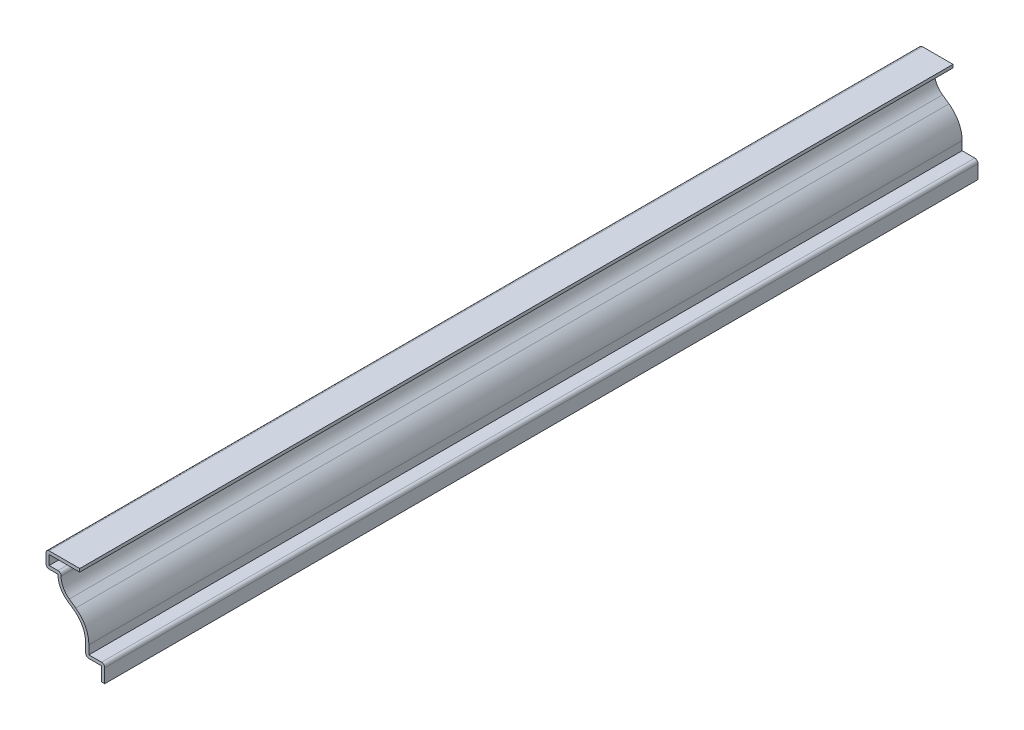
ISO-10303-21;
HEADER;
FILE_DESCRIPTION(('STEP AP214'),'2;1');
FILE_NAME('part.step','',(''),(''),'','','');
FILE_SCHEMA(('AUTOMOTIVE_DESIGN { 1 0 10303 214 1 1 1 1 }'));
ENDSEC;
DATA;
#1=APPLICATION_CONTEXT('core data for automotive mechanical design processes');
#2=APPLICATION_PROTOCOL_DEFINITION('international standard','automotive_design',2000,#1);
#3=PRODUCT_CONTEXT('',#1,'mechanical');
#4=PRODUCT('Part','Part','',(#3));
#5=PRODUCT_RELATED_PRODUCT_CATEGORY('part','',(#4));
#6=PRODUCT_DEFINITION_FORMATION('','',#4);
#7=PRODUCT_DEFINITION_CONTEXT('part definition',#1,'design');
#8=PRODUCT_DEFINITION('design','',#6,#7);
#9=PRODUCT_DEFINITION_SHAPE('','',#8);
#10=(LENGTH_UNIT() NAMED_UNIT(*) SI_UNIT(.MILLI.,.METRE.));
#11=(NAMED_UNIT(*) PLANE_ANGLE_UNIT() SI_UNIT($,.RADIAN.));
#12=(NAMED_UNIT(*) SI_UNIT($,.STERADIAN.) SOLID_ANGLE_UNIT());
#13=UNCERTAINTY_MEASURE_WITH_UNIT(LENGTH_MEASURE(1.E-05),#10,'distance_accuracy_value','');
#14=(GEOMETRIC_REPRESENTATION_CONTEXT(3) GLOBAL_UNCERTAINTY_ASSIGNED_CONTEXT((#13)) GLOBAL_UNIT_ASSIGNED_CONTEXT((#10,
#11,#12)) REPRESENTATION_CONTEXT('',''));
#15=CARTESIAN_POINT('',(0.,0.,0.));
#16=DIRECTION('',(0.,0.,1.));
#17=DIRECTION('',(1.,0.,0.));
#18=AXIS2_PLACEMENT_3D('',#15,#16,#17);
#19=CARTESIAN_POINT('',(-22.225,33.655,-349.25));
#20=DIRECTION('',(0.,-1.,0.));
#21=DIRECTION('',(0.,0.,-1.));
#22=AXIS2_PLACEMENT_3D('',#19,#20,#21);
#23=PLANE('',#22);
#24=DIRECTION('',(1.,0.,0.));
#25=VECTOR('',#24,1.);
#26=CARTESIAN_POINT('',(-22.225,33.655,0.));
#27=LINE('',#26,#25);
#28=CARTESIAN_POINT('',(-20.955,33.655,0.));
#29=VERTEX_POINT('',#28);
#30=CARTESIAN_POINT('',(-8.73125,33.655,0.));
#31=VERTEX_POINT('',#30);
#32=EDGE_CURVE('E275',#29,#31,#27,.T.);
#33=ORIENTED_EDGE('',*,*,#32,.F.);
#34=DIRECTION('',(0.,0.,1.));
#35=VECTOR('',#34,1.);
#36=CARTESIAN_POINT('',(-20.955,33.655,-349.25));
#37=LINE('',#36,#35);
#38=CARTESIAN_POINT('',(-20.955,33.655,-349.25));
#39=VERTEX_POINT('',#38);
#40=EDGE_CURVE('E227',#39,#29,#37,.T.);
#41=ORIENTED_EDGE('',*,*,#40,.F.);
#42=DIRECTION('',(1.,0.,0.));
#43=VECTOR('',#42,1.);
#44=CARTESIAN_POINT('',(-22.225,33.655,-349.25));
#45=LINE('',#44,#43);
#46=CARTESIAN_POINT('',(-8.73125,33.655,-349.25));
#47=VERTEX_POINT('',#46);
#48=EDGE_CURVE('E209',#39,#47,#45,.T.);
#49=ORIENTED_EDGE('',*,*,#48,.T.);
#50=DIRECTION('',(0.,0.,1.));
#51=VECTOR('',#50,1.);
#52=CARTESIAN_POINT('',(-8.73125,33.655,-349.25));
#53=LINE('',#52,#51);
#54=EDGE_CURVE('E217',#47,#31,#53,.T.);
#55=ORIENTED_EDGE('',*,*,#54,.T.);
#56=EDGE_LOOP('',(#33,#41,#49,#55));
#57=FACE_BOUND('',#56,.T.);
#58=ADVANCED_FACE('F35',(#57),#23,.T.);
#59=CARTESIAN_POINT('',(-20.955,28.575,-349.25));
#60=DIRECTION('',(1.,0.,0.));
#61=DIRECTION('',(0.,0.,-1.));
#62=AXIS2_PLACEMENT_3D('',#59,#60,#61);
#63=PLANE('',#62);
#64=DIRECTION('',(0.,1.,0.));
#65=VECTOR('',#64,1.);
#66=CARTESIAN_POINT('',(-20.955,28.575,0.));
#67=LINE('',#66,#65);
#68=CARTESIAN_POINT('',(-20.955,29.845,0.));
#69=VERTEX_POINT('',#68);
#70=EDGE_CURVE('E228',#69,#29,#67,.T.);
#71=ORIENTED_EDGE('',*,*,#70,.F.);
#72=DIRECTION('',(0.,0.,1.));
#73=VECTOR('',#72,1.);
#74=CARTESIAN_POINT('',(-20.955,29.845,-349.25));
#75=LINE('',#74,#73);
#76=CARTESIAN_POINT('',(-20.955,29.845,-349.25));
#77=VERTEX_POINT('',#76);
#78=EDGE_CURVE('E320',#77,#69,#75,.T.);
#79=ORIENTED_EDGE('',*,*,#78,.F.);
#80=DIRECTION('',(0.,1.,0.));
#81=VECTOR('',#80,1.);
#82=CARTESIAN_POINT('',(-20.955,28.575,-349.25));
#83=LINE('',#82,#81);
#84=EDGE_CURVE('E225',#77,#39,#83,.T.);
#85=ORIENTED_EDGE('',*,*,#84,.T.);
#86=ORIENTED_EDGE('',*,*,#40,.T.);
#87=EDGE_LOOP('',(#71,#79,#85,#86));
#88=FACE_BOUND('',#87,.T.);
#89=ADVANCED_FACE('F413',(#88),#63,.T.);
#90=CARTESIAN_POINT('',(-17.4625,29.845,-349.25));
#91=DIRECTION('',(0.,1.,0.));
#92=DIRECTION('',(-1.,0.,0.));
#93=AXIS2_PLACEMENT_3D('',#90,#91,#92);
#94=PLANE('',#93);
#95=DIRECTION('',(-1.,0.,0.));
#96=VECTOR('',#95,1.);
#97=CARTESIAN_POINT('',(-17.4625,29.845,0.));
#98=LINE('',#97,#96);
#99=CARTESIAN_POINT('',(-17.4625,29.845,0.));
#100=VERTEX_POINT('',#99);
#101=EDGE_CURVE('E231',#100,#69,#98,.T.);
#102=ORIENTED_EDGE('',*,*,#101,.F.);
#103=DIRECTION('',(0.,0.,1.));
#104=VECTOR('',#103,1.);
#105=CARTESIAN_POINT('',(-17.4625,29.845,-349.25));
#106=LINE('',#105,#104);
#107=CARTESIAN_POINT('',(-17.4625,29.845,-349.25));
#108=VERTEX_POINT('',#107);
#109=EDGE_CURVE('E384',#100,#108,#106,.F.);
#110=ORIENTED_EDGE('',*,*,#109,.T.);
#111=DIRECTION('',(-1.,0.,0.));
#112=VECTOR('',#111,1.);
#113=CARTESIAN_POINT('',(-17.4625,29.845,-349.25));
#114=LINE('',#113,#112);
#115=EDGE_CURVE('E272',#108,#77,#114,.T.);
#116=ORIENTED_EDGE('',*,*,#115,.T.);
#117=ORIENTED_EDGE('',*,*,#78,.T.);
#118=EDGE_LOOP('',(#102,#110,#116,#117));
#119=FACE_BOUND('',#118,.T.);
#120=ADVANCED_FACE('F498',(#119),#94,.T.);
#121=CARTESIAN_POINT('',(-8.47611607142857,28.575,-349.25));
#122=DIRECTION('',(0.,0.,1.));
#123=DIRECTION('',(1.,0.,0.));
#124=AXIS2_PLACEMENT_3D('',#121,#122,#123);
#125=CYLINDRICAL_SURFACE('',#124,7.71638392857144);
#126=CARTESIAN_POINT('',(-8.47611607142857,28.575,-349.25));
#127=DIRECTION('',(0.,0.,1.));
#128=DIRECTION('',(1.,0.,0.));
#129=AXIS2_PLACEMENT_3D('',#126,#127,#128);
#130=CIRCLE('',#129,7.71638392857144);
#131=CARTESIAN_POINT('',(-12.9224216216216,22.2684202702703,-349.25));
#132=VERTEX_POINT('',#131);
#133=CARTESIAN_POINT('',(-16.1925,28.575,-349.25));
#134=VERTEX_POINT('',#133);
#135=EDGE_CURVE('E269',#132,#134,#130,.F.);
#136=ORIENTED_EDGE('',*,*,#135,.T.);
#137=DIRECTION('',(0.,0.,1.));
#138=VECTOR('',#137,1.);
#139=CARTESIAN_POINT('',(-16.1925,28.575,-349.25));
#140=LINE('',#139,#138);
#141=CARTESIAN_POINT('',(-16.1925,28.575,0.));
#142=VERTEX_POINT('',#141);
#143=EDGE_CURVE('E381',#134,#142,#140,.T.);
#144=ORIENTED_EDGE('',*,*,#143,.T.);
#145=CARTESIAN_POINT('',(-8.47611607142857,28.575,0.));
#146=DIRECTION('',(0.,0.,1.));
#147=DIRECTION('',(1.,0.,0.));
#148=AXIS2_PLACEMENT_3D('',#145,#146,#147);
#149=CIRCLE('',#148,7.71638392857144);
#150=CARTESIAN_POINT('',(-12.9224216216216,22.2684202702703,0.));
#151=VERTEX_POINT('',#150);
#152=EDGE_CURVE('E314',#151,#142,#149,.F.);
#153=ORIENTED_EDGE('',*,*,#152,.F.);
#154=DIRECTION('',(0.,0.,1.));
#155=VECTOR('',#154,1.);
#156=CARTESIAN_POINT('',(-12.9224216216216,22.2684202702703,-349.25));
#157=LINE('',#156,#155);
#158=EDGE_CURVE('E323',#132,#151,#157,.T.);
#159=ORIENTED_EDGE('',*,*,#158,.F.);
#160=EDGE_LOOP('',(#136,#144,#153,#159));
#161=FACE_BOUND('',#160,.T.);
#162=ADVANCED_FACE('F424',(#161),#125,.F.);
#163=CARTESIAN_POINT('',(-10.3275027027027,20.4389337837838,-349.25));
#164=DIRECTION('',(0.576216216216216,0.817297297297298,0.));
#165=DIRECTION('',(-0.817297297297298,0.576216216216216,0.));
#166=AXIS2_PLACEMENT_3D('',#163,#164,#165);
#167=PLANE('',#166);
#168=DIRECTION('',(-0.817297297297298,0.576216216216216,0.));
#169=VECTOR('',#168,1.);
#170=CARTESIAN_POINT('',(-10.3275027027027,20.4389337837838,0.));
#171=LINE('',#170,#169);
#172=CARTESIAN_POINT('',(-10.3275027027027,20.4389337837838,0.));
#173=VERTEX_POINT('',#172);
#174=EDGE_CURVE('E311',#173,#151,#171,.T.);
#175=ORIENTED_EDGE('',*,*,#174,.F.);
#176=DIRECTION('',(0.,0.,1.));
#177=VECTOR('',#176,1.);
#178=CARTESIAN_POINT('',(-10.3275027027027,20.4389337837838,-349.25));
#179=LINE('',#178,#177);
#180=CARTESIAN_POINT('',(-10.3275027027027,20.4389337837838,-349.25));
#181=VERTEX_POINT('',#180);
#182=EDGE_CURVE('E325',#181,#173,#179,.T.);
#183=ORIENTED_EDGE('',*,*,#182,.F.);
#184=DIRECTION('',(-0.817297297297298,0.576216216216216,0.));
#185=VECTOR('',#184,1.);
#186=CARTESIAN_POINT('',(-10.3275027027027,20.4389337837838,-349.25));
#187=LINE('',#186,#185);
#188=EDGE_CURVE('E266',#181,#132,#187,.T.);
#189=ORIENTED_EDGE('',*,*,#188,.T.);
#190=ORIENTED_EDGE('',*,*,#158,.T.);
#191=EDGE_LOOP('',(#175,#183,#189,#190));
#192=FACE_BOUND('',#191,.T.);
#193=ADVANCED_FACE('F428',(#192),#167,.T.);
#194=CARTESIAN_POINT('',(-17.4625,10.31875,-349.25));
#195=DIRECTION('',(0.,0.,1.));
#196=DIRECTION('',(1.,0.,0.));
#197=AXIS2_PLACEMENT_3D('',#194,#195,#196);
#198=CYLINDRICAL_SURFACE('',#197,12.3825);
#199=CARTESIAN_POINT('',(-17.4625,10.31875,0.));
#200=DIRECTION('',(0.,0.,1.));
#201=DIRECTION('',(1.,0.,0.));
#202=AXIS2_PLACEMENT_3D('',#199,#200,#201);
#203=CIRCLE('',#202,12.3825);
#204=CARTESIAN_POINT('',(-5.08,10.31875,0.));
#205=VERTEX_POINT('',#204);
#206=EDGE_CURVE('E308',#205,#173,#203,.T.);
#207=ORIENTED_EDGE('',*,*,#206,.F.);
#208=DIRECTION('',(0.,0.,1.));
#209=VECTOR('',#208,1.);
#210=CARTESIAN_POINT('',(-5.08,10.31875,-349.25));
#211=LINE('',#210,#209);
#212=CARTESIAN_POINT('',(-5.08,10.31875,-349.25));
#213=VERTEX_POINT('',#212);
#214=EDGE_CURVE('E327',#213,#205,#211,.T.);
#215=ORIENTED_EDGE('',*,*,#214,.F.);
#216=CARTESIAN_POINT('',(-17.4625,10.31875,-349.25));
#217=DIRECTION('',(0.,0.,1.));
#218=DIRECTION('',(1.,0.,0.));
#219=AXIS2_PLACEMENT_3D('',#216,#217,#218);
#220=CIRCLE('',#219,12.3825);
#221=EDGE_CURVE('E263',#213,#181,#220,.T.);
#222=ORIENTED_EDGE('',*,*,#221,.T.);
#223=ORIENTED_EDGE('',*,*,#182,.T.);
#224=EDGE_LOOP('',(#207,#215,#222,#223));
#225=FACE_BOUND('',#224,.T.);
#226=ADVANCED_FACE('F433',(#225),#198,.T.);
#227=CARTESIAN_POINT('',(-5.08,5.55625,-349.25));
#228=DIRECTION('',(1.,0.,0.));
#229=DIRECTION('',(0.,1.,0.));
#230=AXIS2_PLACEMENT_3D('',#227,#228,#229);
#231=PLANE('',#230);
#232=DIRECTION('',(0.,1.,0.));
#233=VECTOR('',#232,1.);
#234=CARTESIAN_POINT('',(-5.08,5.55625,0.));
#235=LINE('',#234,#233);
#236=CARTESIAN_POINT('',(-5.08,6.82625,0.));
#237=VERTEX_POINT('',#236);
#238=EDGE_CURVE('E305',#237,#205,#235,.T.);
#239=ORIENTED_EDGE('',*,*,#238,.F.);
#240=DIRECTION('',(0.,0.,1.));
#241=VECTOR('',#240,1.);
#242=CARTESIAN_POINT('',(-5.08,6.82625,-349.25));
#243=LINE('',#242,#241);
#244=CARTESIAN_POINT('',(-5.08,6.82625,-349.25));
#245=VERTEX_POINT('',#244);
#246=EDGE_CURVE('E329',#245,#237,#243,.T.);
#247=ORIENTED_EDGE('',*,*,#246,.F.);
#248=DIRECTION('',(0.,1.,0.));
#249=VECTOR('',#248,1.);
#250=CARTESIAN_POINT('',(-5.08,5.55625,-349.25));
#251=LINE('',#250,#249);
#252=EDGE_CURVE('E260',#245,#213,#251,.T.);
#253=ORIENTED_EDGE('',*,*,#252,.T.);
#254=ORIENTED_EDGE('',*,*,#214,.T.);
#255=EDGE_LOOP('',(#239,#247,#253,#254));
#256=FACE_BOUND('',#255,.T.);
#257=ADVANCED_FACE('F436',(#256),#231,.T.);
#258=CARTESIAN_POINT('',(0.,6.82625,-349.25));
#259=DIRECTION('',(0.,1.,0.));
#260=DIRECTION('',(-1.,0.,0.));
#261=AXIS2_PLACEMENT_3D('',#258,#259,#260);
#262=PLANE('',#261);
#263=DIRECTION('',(-1.,0.,0.));
#264=VECTOR('',#263,1.);
#265=CARTESIAN_POINT('',(0.,6.82625,0.));
#266=LINE('',#265,#264);
#267=CARTESIAN_POINT('',(0.,6.82625,0.));
#268=VERTEX_POINT('',#267);
#269=EDGE_CURVE('E303',#268,#237,#266,.T.);
#270=ORIENTED_EDGE('',*,*,#269,.F.);
#271=DIRECTION('',(0.,0.,1.));
#272=VECTOR('',#271,1.);
#273=CARTESIAN_POINT('',(0.,6.82625,-349.25));
#274=LINE('',#273,#272);
#275=CARTESIAN_POINT('',(0.,6.82625,-349.25));
#276=VERTEX_POINT('',#275);
#277=EDGE_CURVE('E365',#268,#276,#274,.F.);
#278=ORIENTED_EDGE('',*,*,#277,.T.);
#279=DIRECTION('',(-1.,0.,0.));
#280=VECTOR('',#279,1.);
#281=CARTESIAN_POINT('',(0.,6.82625,-349.25));
#282=LINE('',#281,#280);
#283=EDGE_CURVE('E258',#276,#245,#282,.T.);
#284=ORIENTED_EDGE('',*,*,#283,.T.);
#285=ORIENTED_EDGE('',*,*,#246,.T.);
#286=EDGE_LOOP('',(#270,#278,#284,#285));
#287=FACE_BOUND('',#286,.T.);
#288=ADVANCED_FACE('F607',(#287),#262,.T.);
#289=CARTESIAN_POINT('',(1.27,0.,-349.25));
#290=DIRECTION('',(1.,0.,0.));
#291=DIRECTION('',(0.,1.,0.));
#292=AXIS2_PLACEMENT_3D('',#289,#290,#291);
#293=PLANE('',#292);
#294=DIRECTION('',(0.,1.,0.));
#295=VECTOR('',#294,1.);
#296=CARTESIAN_POINT('',(1.27,0.,-349.25));
#297=LINE('',#296,#295);
#298=CARTESIAN_POINT('',(1.27,0.,-349.25));
#299=VERTEX_POINT('',#298);
#300=CARTESIAN_POINT('',(1.27,5.55625,-349.25));
#301=VERTEX_POINT('',#300);
#302=EDGE_CURVE('E255',#299,#301,#297,.T.);
#303=ORIENTED_EDGE('',*,*,#302,.T.);
#304=DIRECTION('',(0.,0.,1.));
#305=VECTOR('',#304,1.);
#306=CARTESIAN_POINT('',(1.27,5.55625,-349.25));
#307=LINE('',#306,#305);
#308=CARTESIAN_POINT('',(1.27,5.55625,0.));
#309=VERTEX_POINT('',#308);
#310=EDGE_CURVE('E319',#301,#309,#307,.T.);
#311=ORIENTED_EDGE('',*,*,#310,.T.);
#312=DIRECTION('',(0.,1.,0.));
#313=VECTOR('',#312,1.);
#314=CARTESIAN_POINT('',(1.27,0.,0.));
#315=LINE('',#314,#313);
#316=CARTESIAN_POINT('',(1.27,0.,0.));
#317=VERTEX_POINT('',#316);
#318=EDGE_CURVE('E300',#317,#309,#315,.T.);
#319=ORIENTED_EDGE('',*,*,#318,.F.);
#320=DIRECTION('',(0.,0.,1.));
#321=VECTOR('',#320,1.);
#322=CARTESIAN_POINT('',(1.27,0.,-349.25));
#323=LINE('',#322,#321);
#324=EDGE_CURVE('E332',#299,#317,#323,.T.);
#325=ORIENTED_EDGE('',*,*,#324,.F.);
#326=EDGE_LOOP('',(#303,#311,#319,#325));
#327=FACE_BOUND('',#326,.T.);
#328=ADVANCED_FACE('F447',(#327),#293,.T.);
#329=CARTESIAN_POINT('',(1.27,0.,-349.25));
#330=DIRECTION('',(0.,1.,0.));
#331=DIRECTION('',(-1.,0.,0.));
#332=AXIS2_PLACEMENT_3D('',#329,#330,#331);
#333=PLANE('',#332);
#334=DIRECTION('',(-1.,0.,0.));
#335=VECTOR('',#334,1.);
#336=CARTESIAN_POINT('',(1.27,0.,0.));
#337=LINE('',#336,#335);
#338=CARTESIAN_POINT('',(0.,0.,0.));
#339=VERTEX_POINT('',#338);
#340=EDGE_CURVE('E298',#317,#339,#337,.T.);
#341=ORIENTED_EDGE('',*,*,#340,.T.);
#342=DIRECTION('',(0.,0.,1.));
#343=VECTOR('',#342,1.);
#344=CARTESIAN_POINT('',(0.,0.,-349.25));
#345=LINE('',#344,#343);
#346=CARTESIAN_POINT('',(0.,0.,-349.25));
#347=VERTEX_POINT('',#346);
#348=EDGE_CURVE('E334',#347,#339,#345,.T.);
#349=ORIENTED_EDGE('',*,*,#348,.F.);
#350=DIRECTION('',(-1.,0.,0.));
#351=VECTOR('',#350,1.);
#352=CARTESIAN_POINT('',(1.27,0.,-349.25));
#353=LINE('',#352,#351);
#354=EDGE_CURVE('E253',#299,#347,#353,.T.);
#355=ORIENTED_EDGE('',*,*,#354,.F.);
#356=ORIENTED_EDGE('',*,*,#324,.T.);
#357=EDGE_LOOP('',(#341,#349,#355,#356));
#358=FACE_BOUND('',#357,.T.);
#359=ADVANCED_FACE('F454',(#358),#333,.F.);
#360=CARTESIAN_POINT('',(0.,0.,-349.25));
#361=DIRECTION('',(1.,0.,0.));
#362=DIRECTION('',(0.,1.,0.));
#363=AXIS2_PLACEMENT_3D('',#360,#361,#362);
#364=PLANE('',#363);
#365=DIRECTION('',(0.,1.,0.));
#366=VECTOR('',#365,1.);
#367=CARTESIAN_POINT('',(0.,0.,0.));
#368=LINE('',#367,#366);
#369=CARTESIAN_POINT('',(0.,5.55625,0.));
#370=VERTEX_POINT('',#369);
#371=EDGE_CURVE('E296',#339,#370,#368,.T.);
#372=ORIENTED_EDGE('',*,*,#371,.T.);
#373=DIRECTION('',(0.,0.,1.));
#374=VECTOR('',#373,1.);
#375=CARTESIAN_POINT('',(0.,5.55625,-349.25));
#376=LINE('',#375,#374);
#377=CARTESIAN_POINT('',(0.,5.55625,-349.25));
#378=VERTEX_POINT('',#377);
#379=EDGE_CURVE('E337',#378,#370,#376,.T.);
#380=ORIENTED_EDGE('',*,*,#379,.F.);
#381=DIRECTION('',(0.,1.,0.));
#382=VECTOR('',#381,1.);
#383=CARTESIAN_POINT('',(0.,0.,-349.25));
#384=LINE('',#383,#382);
#385=EDGE_CURVE('E251',#347,#378,#384,.T.);
#386=ORIENTED_EDGE('',*,*,#385,.F.);
#387=ORIENTED_EDGE('',*,*,#348,.T.);
#388=EDGE_LOOP('',(#372,#380,#386,#387));
#389=FACE_BOUND('',#388,.T.);
#390=ADVANCED_FACE('F458',(#389),#364,.F.);
#391=CARTESIAN_POINT('',(0.,5.55625,-349.25));
#392=DIRECTION('',(0.,1.,0.));
#393=DIRECTION('',(-1.,0.,0.));
#394=AXIS2_PLACEMENT_3D('',#391,#392,#393);
#395=PLANE('',#394);
#396=DIRECTION('',(-1.,0.,0.));
#397=VECTOR('',#396,1.);
#398=CARTESIAN_POINT('',(0.,5.55625,0.));
#399=LINE('',#398,#397);
#400=CARTESIAN_POINT('',(-5.08,5.55625,0.));
#401=VERTEX_POINT('',#400);
#402=EDGE_CURVE('E293',#370,#401,#399,.T.);
#403=ORIENTED_EDGE('',*,*,#402,.T.);
#404=DIRECTION('',(0.,0.,1.));
#405=VECTOR('',#404,1.);
#406=CARTESIAN_POINT('',(-5.08,5.55625,-349.25));
#407=LINE('',#406,#405);
#408=CARTESIAN_POINT('',(-5.08,5.55625,-349.25));
#409=VERTEX_POINT('',#408);
#410=EDGE_CURVE('E379',#401,#409,#407,.F.);
#411=ORIENTED_EDGE('',*,*,#410,.T.);
#412=DIRECTION('',(-1.,0.,0.));
#413=VECTOR('',#412,1.);
#414=CARTESIAN_POINT('',(0.,5.55625,-349.25));
#415=LINE('',#414,#413);
#416=EDGE_CURVE('E248',#378,#409,#415,.T.);
#417=ORIENTED_EDGE('',*,*,#416,.F.);
#418=ORIENTED_EDGE('',*,*,#379,.T.);
#419=EDGE_LOOP('',(#403,#411,#417,#418));
#420=FACE_BOUND('',#419,.T.);
#421=ADVANCED_FACE('F586',(#420),#395,.F.);
#422=CARTESIAN_POINT('',(-6.35,5.55625,-349.25));
#423=DIRECTION('',(1.,0.,0.));
#424=DIRECTION('',(0.,1.,0.));
#425=AXIS2_PLACEMENT_3D('',#422,#423,#424);
#426=PLANE('',#425);
#427=DIRECTION('',(0.,1.,0.));
#428=VECTOR('',#427,1.);
#429=CARTESIAN_POINT('',(-6.35,5.55625,-349.25));
#430=LINE('',#429,#428);
#431=CARTESIAN_POINT('',(-6.35,6.82625,-349.25));
#432=VERTEX_POINT('',#431);
#433=CARTESIAN_POINT('',(-6.35,10.31875,-349.25));
#434=VERTEX_POINT('',#433);
#435=EDGE_CURVE('E246',#432,#434,#430,.T.);
#436=ORIENTED_EDGE('',*,*,#435,.F.);
#437=DIRECTION('',(0.,0.,1.));
#438=VECTOR('',#437,1.);
#439=CARTESIAN_POINT('',(-6.35,6.82625,-349.25));
#440=LINE('',#439,#438);
#441=CARTESIAN_POINT('',(-6.35,6.82625,0.));
#442=VERTEX_POINT('',#441);
#443=EDGE_CURVE('E376',#432,#442,#440,.T.);
#444=ORIENTED_EDGE('',*,*,#443,.T.);
#445=DIRECTION('',(0.,1.,0.));
#446=VECTOR('',#445,1.);
#447=CARTESIAN_POINT('',(-6.35,5.55625,0.));
#448=LINE('',#447,#446);
#449=CARTESIAN_POINT('',(-6.35,10.31875,0.));
#450=VERTEX_POINT('',#449);
#451=EDGE_CURVE('E291',#442,#450,#448,.T.);
#452=ORIENTED_EDGE('',*,*,#451,.T.);
#453=DIRECTION('',(0.,0.,1.));
#454=VECTOR('',#453,1.);
#455=CARTESIAN_POINT('',(-6.35,10.31875,-349.25));
#456=LINE('',#455,#454);
#457=EDGE_CURVE('E340',#434,#450,#456,.T.);
#458=ORIENTED_EDGE('',*,*,#457,.F.);
#459=EDGE_LOOP('',(#436,#444,#452,#458));
#460=FACE_BOUND('',#459,.T.);
#461=ADVANCED_FACE('F470',(#460),#426,.F.);
#462=CARTESIAN_POINT('',(-17.4625,10.31875,-349.25));
#463=DIRECTION('',(0.,0.,1.));
#464=DIRECTION('',(1.,0.,0.));
#465=AXIS2_PLACEMENT_3D('',#462,#463,#464);
#466=CYLINDRICAL_SURFACE('',#465,11.1125);
#467=CARTESIAN_POINT('',(-17.4625,10.31875,0.));
#468=DIRECTION('',(0.,0.,1.));
#469=DIRECTION('',(1.,0.,0.));
#470=AXIS2_PLACEMENT_3D('',#467,#468,#469);
#471=CIRCLE('',#470,11.1125);
#472=CARTESIAN_POINT('',(-11.0592972972973,19.4009662162162,0.));
#473=VERTEX_POINT('',#472);
#474=EDGE_CURVE('E289',#450,#473,#471,.T.);
#475=ORIENTED_EDGE('',*,*,#474,.T.);
#476=DIRECTION('',(0.,0.,1.));
#477=VECTOR('',#476,1.);
#478=CARTESIAN_POINT('',(-11.0592972972973,19.4009662162162,-349.25));
#479=LINE('',#478,#477);
#480=CARTESIAN_POINT('',(-11.0592972972973,19.4009662162162,-349.25));
#481=VERTEX_POINT('',#480);
#482=EDGE_CURVE('E343',#481,#473,#479,.T.);
#483=ORIENTED_EDGE('',*,*,#482,.F.);
#484=CARTESIAN_POINT('',(-17.4625,10.31875,-349.25));
#485=DIRECTION('',(0.,0.,1.));
#486=DIRECTION('',(1.,0.,0.));
#487=AXIS2_PLACEMENT_3D('',#484,#485,#486);
#488=CIRCLE('',#487,11.1125);
#489=EDGE_CURVE('E244',#434,#481,#488,.T.);
#490=ORIENTED_EDGE('',*,*,#489,.F.);
#491=ORIENTED_EDGE('',*,*,#457,.T.);
#492=EDGE_LOOP('',(#475,#483,#490,#491));
#493=FACE_BOUND('',#492,.T.);
#494=ADVANCED_FACE('F477',(#493),#466,.F.);
#495=CARTESIAN_POINT('',(-11.0592972972973,19.4009662162162,-349.25));
#496=DIRECTION('',(0.576216216216216,0.817297297297298,0.));
#497=DIRECTION('',(-0.817297297297298,0.576216216216216,0.));
#498=AXIS2_PLACEMENT_3D('',#495,#496,#497);
#499=PLANE('',#498);
#500=DIRECTION('',(-0.817297297297298,0.576216216216216,0.));
#501=VECTOR('',#500,1.);
#502=CARTESIAN_POINT('',(-11.0592972972973,19.4009662162162,0.));
#503=LINE('',#502,#501);
#504=CARTESIAN_POINT('',(-13.6542162162162,21.2304527027027,0.));
#505=VERTEX_POINT('',#504);
#506=EDGE_CURVE('E287',#473,#505,#503,.T.);
#507=ORIENTED_EDGE('',*,*,#506,.T.);
#508=DIRECTION('',(0.,0.,1.));
#509=VECTOR('',#508,1.);
#510=CARTESIAN_POINT('',(-13.6542162162162,21.2304527027027,-349.25));
#511=LINE('',#510,#509);
#512=CARTESIAN_POINT('',(-13.6542162162162,21.2304527027027,-349.25));
#513=VERTEX_POINT('',#512);
#514=EDGE_CURVE('E346',#513,#505,#511,.T.);
#515=ORIENTED_EDGE('',*,*,#514,.F.);
#516=DIRECTION('',(-0.817297297297298,0.576216216216216,0.));
#517=VECTOR('',#516,1.);
#518=CARTESIAN_POINT('',(-11.0592972972973,19.4009662162162,-349.25));
#519=LINE('',#518,#517);
#520=EDGE_CURVE('E242',#481,#513,#519,.T.);
#521=ORIENTED_EDGE('',*,*,#520,.F.);
#522=ORIENTED_EDGE('',*,*,#482,.T.);
#523=EDGE_LOOP('',(#507,#515,#521,#522));
#524=FACE_BOUND('',#523,.T.);
#525=ADVANCED_FACE('F481',(#524),#499,.F.);
#526=CARTESIAN_POINT('',(-8.47611607142857,28.575,-349.25));
#527=DIRECTION('',(0.,0.,1.));
#528=DIRECTION('',(1.,0.,0.));
#529=AXIS2_PLACEMENT_3D('',#526,#527,#528);
#530=CYLINDRICAL_SURFACE('',#529,8.98638392857143);
#531=CARTESIAN_POINT('',(-8.47611607142857,28.575,0.));
#532=DIRECTION('',(0.,0.,-1.));
#533=DIRECTION('',(-1.,0.,0.));
#534=AXIS2_PLACEMENT_3D('',#531,#532,#533);
#535=CIRCLE('',#534,8.98638392857143);
#536=CARTESIAN_POINT('',(-17.4625,28.575,0.));
#537=VERTEX_POINT('',#536);
#538=EDGE_CURVE('E285',#505,#537,#535,.T.);
#539=ORIENTED_EDGE('',*,*,#538,.T.);
#540=DIRECTION('',(0.,0.,1.));
#541=VECTOR('',#540,1.);
#542=CARTESIAN_POINT('',(-17.4625,28.575,-349.25));
#543=LINE('',#542,#541);
#544=CARTESIAN_POINT('',(-17.4625,28.575,-349.25));
#545=VERTEX_POINT('',#544);
#546=EDGE_CURVE('E349',#545,#537,#543,.T.);
#547=ORIENTED_EDGE('',*,*,#546,.F.);
#548=CARTESIAN_POINT('',(-8.47611607142857,28.575,-349.25));
#549=DIRECTION('',(0.,0.,-1.));
#550=DIRECTION('',(-1.,0.,0.));
#551=AXIS2_PLACEMENT_3D('',#548,#549,#550);
#552=CIRCLE('',#551,8.98638392857143);
#553=EDGE_CURVE('E240',#513,#545,#552,.T.);
#554=ORIENTED_EDGE('',*,*,#553,.F.);
#555=ORIENTED_EDGE('',*,*,#514,.T.);
#556=EDGE_LOOP('',(#539,#547,#554,#555));
#557=FACE_BOUND('',#556,.T.);
#558=ADVANCED_FACE('F484',(#557),#530,.T.);
#559=CARTESIAN_POINT('',(-17.4625,28.575,-349.25));
#560=DIRECTION('',(0.,1.,0.));
#561=DIRECTION('',(-1.,0.,0.));
#562=AXIS2_PLACEMENT_3D('',#559,#560,#561);
#563=PLANE('',#562);
#564=DIRECTION('',(-1.,0.,0.));
#565=VECTOR('',#564,1.);
#566=CARTESIAN_POINT('',(-17.4625,28.575,0.));
#567=LINE('',#566,#565);
#568=CARTESIAN_POINT('',(-20.955,28.575,0.));
#569=VERTEX_POINT('',#568);
#570=EDGE_CURVE('E282',#537,#569,#567,.T.);
#571=ORIENTED_EDGE('',*,*,#570,.T.);
#572=DIRECTION('',(0.,0.,1.));
#573=VECTOR('',#572,1.);
#574=CARTESIAN_POINT('',(-20.955,28.575,-349.25));
#575=LINE('',#574,#573);
#576=CARTESIAN_POINT('',(-20.955,28.575,-349.25));
#577=VERTEX_POINT('',#576);
#578=EDGE_CURVE('E43',#569,#577,#575,.F.);
#579=ORIENTED_EDGE('',*,*,#578,.T.);
#580=DIRECTION('',(-1.,0.,0.));
#581=VECTOR('',#580,1.);
#582=CARTESIAN_POINT('',(-17.4625,28.575,-349.25));
#583=LINE('',#582,#581);
#584=EDGE_CURVE('E237',#545,#577,#583,.T.);
#585=ORIENTED_EDGE('',*,*,#584,.F.);
#586=ORIENTED_EDGE('',*,*,#546,.T.);
#587=EDGE_LOOP('',(#571,#579,#585,#586));
#588=FACE_BOUND('',#587,.T.);
#589=ADVANCED_FACE('F392',(#588),#563,.F.);
#590=CARTESIAN_POINT('',(-22.225,28.575,-349.25));
#591=DIRECTION('',(1.,0.,0.));
#592=DIRECTION('',(0.,0.,-1.));
#593=AXIS2_PLACEMENT_3D('',#590,#591,#592);
#594=PLANE('',#593);
#595=DIRECTION('',(0.,1.,0.));
#596=VECTOR('',#595,1.);
#597=CARTESIAN_POINT('',(-22.225,28.575,-349.25));
#598=LINE('',#597,#596);
#599=CARTESIAN_POINT('',(-22.225,29.845,-349.25));
#600=VERTEX_POINT('',#599);
#601=CARTESIAN_POINT('',(-22.225,33.655,-349.25));
#602=VERTEX_POINT('',#601);
#603=EDGE_CURVE('E235',#600,#602,#598,.T.);
#604=ORIENTED_EDGE('',*,*,#603,.F.);
#605=DIRECTION('',(0.,0.,1.));
#606=VECTOR('',#605,1.);
#607=CARTESIAN_POINT('',(-22.225,29.845,-349.25));
#608=LINE('',#607,#606);
#609=CARTESIAN_POINT('',(-22.225,29.845,0.));
#610=VERTEX_POINT('',#609);
#611=EDGE_CURVE('E387',#600,#610,#608,.T.);
#612=ORIENTED_EDGE('',*,*,#611,.T.);
#613=DIRECTION('',(0.,1.,0.));
#614=VECTOR('',#613,1.);
#615=CARTESIAN_POINT('',(-22.225,28.575,0.));
#616=LINE('',#615,#614);
#617=CARTESIAN_POINT('',(-22.225,33.655,0.));
#618=VERTEX_POINT('',#617);
#619=EDGE_CURVE('E280',#610,#618,#616,.T.);
#620=ORIENTED_EDGE('',*,*,#619,.T.);
#621=DIRECTION('',(0.,0.,1.));
#622=VECTOR('',#621,1.);
#623=CARTESIAN_POINT('',(-22.225,33.655,-349.25));
#624=LINE('',#623,#622);
#625=EDGE_CURVE('E58',#618,#602,#624,.F.);
#626=ORIENTED_EDGE('',*,*,#625,.T.);
#627=EDGE_LOOP('',(#604,#612,#620,#626));
#628=FACE_BOUND('',#627,.T.);
#629=ADVANCED_FACE('F401',(#628),#594,.F.);
#630=CARTESIAN_POINT('',(-22.225,34.925,-349.25));
#631=DIRECTION('',(0.,-1.,0.));
#632=DIRECTION('',(0.,0.,-1.));
#633=AXIS2_PLACEMENT_3D('',#630,#631,#632);
#634=PLANE('',#633);
#635=DIRECTION('',(1.,0.,0.));
#636=VECTOR('',#635,1.);
#637=CARTESIAN_POINT('',(-22.225,34.925,-349.25));
#638=LINE('',#637,#636);
#639=CARTESIAN_POINT('',(-20.955,34.925,-349.25));
#640=VERTEX_POINT('',#639);
#641=CARTESIAN_POINT('',(-8.73125,34.925,-349.25));
#642=VERTEX_POINT('',#641);
#643=EDGE_CURVE('E211',#640,#642,#638,.T.);
#644=ORIENTED_EDGE('',*,*,#643,.F.);
#645=DIRECTION('',(0.,0.,1.));
#646=VECTOR('',#645,1.);
#647=CARTESIAN_POINT('',(-20.955,34.925,-349.25));
#648=LINE('',#647,#646);
#649=CARTESIAN_POINT('',(-20.955,34.925,0.));
#650=VERTEX_POINT('',#649);
#651=EDGE_CURVE('E11',#640,#650,#648,.T.);
#652=ORIENTED_EDGE('',*,*,#651,.T.);
#653=DIRECTION('',(1.,0.,0.));
#654=VECTOR('',#653,1.);
#655=CARTESIAN_POINT('',(-22.225,34.925,0.));
#656=LINE('',#655,#654);
#657=CARTESIAN_POINT('',(-8.73125,34.925,0.));
#658=VERTEX_POINT('',#657);
#659=EDGE_CURVE('E278',#650,#658,#656,.T.);
#660=ORIENTED_EDGE('',*,*,#659,.T.);
#661=DIRECTION('',(0.,0.,1.));
#662=VECTOR('',#661,1.);
#663=CARTESIAN_POINT('',(-8.73125,34.925,-349.25));
#664=LINE('',#663,#662);
#665=EDGE_CURVE('E224',#642,#658,#664,.T.);
#666=ORIENTED_EDGE('',*,*,#665,.F.);
#667=EDGE_LOOP('',(#644,#652,#660,#666));
#668=FACE_BOUND('',#667,.T.);
#669=ADVANCED_FACE('F408',(#668),#634,.F.);
#670=CARTESIAN_POINT('',(-8.73125,34.925,-349.25));
#671=DIRECTION('',(-1.,0.,0.));
#672=DIRECTION('',(0.,0.,1.));
#673=AXIS2_PLACEMENT_3D('',#670,#671,#672);
#674=PLANE('',#673);
#675=DIRECTION('',(0.,-1.,0.));
#676=VECTOR('',#675,1.);
#677=CARTESIAN_POINT('',(-8.73125,34.925,0.));
#678=LINE('',#677,#676);
#679=EDGE_CURVE('E220',#658,#31,#678,.T.);
#680=ORIENTED_EDGE('',*,*,#679,.T.);
#681=ORIENTED_EDGE('',*,*,#54,.F.);
#682=DIRECTION('',(0.,-1.,0.));
#683=VECTOR('',#682,1.);
#684=CARTESIAN_POINT('',(-8.73125,34.925,-349.25));
#685=LINE('',#684,#683);
#686=EDGE_CURVE('E203',#642,#47,#685,.T.);
#687=ORIENTED_EDGE('',*,*,#686,.F.);
#688=ORIENTED_EDGE('',*,*,#665,.T.);
#689=EDGE_LOOP('',(#680,#681,#687,#688));
#690=FACE_BOUND('',#689,.T.);
#691=ADVANCED_FACE('F218',(#690),#674,.F.);
#692=CARTESIAN_POINT('',(-8.47611607142857,28.575,-349.25));
#693=DIRECTION('',(0.,0.,-1.));
#694=DIRECTION('',(-1.,0.,0.));
#695=AXIS2_PLACEMENT_3D('',#692,#693,#694);
#696=PLANE('',#695);
#697=ORIENTED_EDGE('',*,*,#283,.F.);
#698=CARTESIAN_POINT('',(0.,5.55625,-349.25));
#699=DIRECTION('',(0.,0.,-1.));
#700=DIRECTION('',(-1.,0.,0.));
#701=AXIS2_PLACEMENT_3D('',#698,#699,#700);
#702=CIRCLE('',#701,1.27);
#703=EDGE_CURVE('E374',#276,#301,#702,.T.);
#704=ORIENTED_EDGE('',*,*,#703,.T.);
#705=ORIENTED_EDGE('',*,*,#302,.F.);
#706=ORIENTED_EDGE('',*,*,#354,.T.);
#707=ORIENTED_EDGE('',*,*,#385,.T.);
#708=ORIENTED_EDGE('',*,*,#416,.T.);
#709=CARTESIAN_POINT('',(-5.08,6.82625,-349.25));
#710=DIRECTION('',(0.,0.,-1.));
#711=DIRECTION('',(-1.,0.,0.));
#712=AXIS2_PLACEMENT_3D('',#709,#710,#711);
#713=CIRCLE('',#712,1.27);
#714=EDGE_CURVE('E372',#409,#432,#713,.T.);
#715=ORIENTED_EDGE('',*,*,#714,.T.);
#716=ORIENTED_EDGE('',*,*,#435,.T.);
#717=ORIENTED_EDGE('',*,*,#489,.T.);
#718=ORIENTED_EDGE('',*,*,#520,.T.);
#719=ORIENTED_EDGE('',*,*,#553,.T.);
#720=ORIENTED_EDGE('',*,*,#584,.T.);
#721=CARTESIAN_POINT('',(-20.955,29.845,-349.25));
#722=DIRECTION('',(0.,0.,-1.));
#723=DIRECTION('',(-1.,0.,0.));
#724=AXIS2_PLACEMENT_3D('',#721,#722,#723);
#725=CIRCLE('',#724,1.27);
#726=EDGE_CURVE('E368',#577,#600,#725,.T.);
#727=ORIENTED_EDGE('',*,*,#726,.T.);
#728=ORIENTED_EDGE('',*,*,#603,.T.);
#729=CARTESIAN_POINT('',(-20.955,33.655,-349.25));
#730=DIRECTION('',(0.,0.,-1.));
#731=DIRECTION('',(-1.,0.,0.));
#732=AXIS2_PLACEMENT_3D('',#729,#730,#731);
#733=CIRCLE('',#732,1.27);
#734=EDGE_CURVE('E50',#602,#640,#733,.T.);
#735=ORIENTED_EDGE('',*,*,#734,.T.);
#736=ORIENTED_EDGE('',*,*,#643,.T.);
#737=ORIENTED_EDGE('',*,*,#686,.T.);
#738=ORIENTED_EDGE('',*,*,#48,.F.);
#739=ORIENTED_EDGE('',*,*,#84,.F.);
#740=ORIENTED_EDGE('',*,*,#115,.F.);
#741=CARTESIAN_POINT('',(-17.4625,28.575,-349.25));
#742=DIRECTION('',(0.,0.,-1.));
#743=DIRECTION('',(-1.,0.,0.));
#744=AXIS2_PLACEMENT_3D('',#741,#742,#743);
#745=CIRCLE('',#744,1.27);
#746=EDGE_CURVE('E370',#108,#134,#745,.T.);
#747=ORIENTED_EDGE('',*,*,#746,.T.);
#748=ORIENTED_EDGE('',*,*,#135,.F.);
#749=ORIENTED_EDGE('',*,*,#188,.F.);
#750=ORIENTED_EDGE('',*,*,#221,.F.);
#751=ORIENTED_EDGE('',*,*,#252,.F.);
#752=EDGE_LOOP('',(#697,#704,#705,#706,#707,#708,#715,#716,#717,#718,#719,#720,#727,#728,#735,
#736,#737,#738,#739,#740,#747,#748,#749,#750,#751));
#753=FACE_BOUND('',#752,.T.);
#754=ADVANCED_FACE('F206',(#753),#696,.T.);
#755=CARTESIAN_POINT('',(-8.47611607142857,28.575,0.));
#756=DIRECTION('',(0.,0.,-1.));
#757=DIRECTION('',(-1.,0.,0.));
#758=AXIS2_PLACEMENT_3D('',#755,#756,#757);
#759=PLANE('',#758);
#760=ORIENTED_EDGE('',*,*,#318,.T.);
#761=CARTESIAN_POINT('',(0.,5.55625,0.));
#762=DIRECTION('',(0.,0.,-1.));
#763=DIRECTION('',(-1.,0.,0.));
#764=AXIS2_PLACEMENT_3D('',#761,#762,#763);
#765=CIRCLE('',#764,1.27);
#766=EDGE_CURVE('E363',#309,#268,#765,.F.);
#767=ORIENTED_EDGE('',*,*,#766,.T.);
#768=ORIENTED_EDGE('',*,*,#269,.T.);
#769=ORIENTED_EDGE('',*,*,#238,.T.);
#770=ORIENTED_EDGE('',*,*,#206,.T.);
#771=ORIENTED_EDGE('',*,*,#174,.T.);
#772=ORIENTED_EDGE('',*,*,#152,.T.);
#773=CARTESIAN_POINT('',(-17.4625,28.575,0.));
#774=DIRECTION('',(0.,0.,-1.));
#775=DIRECTION('',(-1.,0.,0.));
#776=AXIS2_PLACEMENT_3D('',#773,#774,#775);
#777=CIRCLE('',#776,1.27);
#778=EDGE_CURVE('E359',#142,#100,#777,.F.);
#779=ORIENTED_EDGE('',*,*,#778,.T.);
#780=ORIENTED_EDGE('',*,*,#101,.T.);
#781=ORIENTED_EDGE('',*,*,#70,.T.);
#782=ORIENTED_EDGE('',*,*,#32,.T.);
#783=ORIENTED_EDGE('',*,*,#679,.F.);
#784=ORIENTED_EDGE('',*,*,#659,.F.);
#785=CARTESIAN_POINT('',(-20.955,33.655,0.));
#786=DIRECTION('',(0.,0.,-1.));
#787=DIRECTION('',(-1.,0.,0.));
#788=AXIS2_PLACEMENT_3D('',#785,#786,#787);
#789=CIRCLE('',#788,1.27);
#790=EDGE_CURVE('E355',#650,#618,#789,.F.);
#791=ORIENTED_EDGE('',*,*,#790,.T.);
#792=ORIENTED_EDGE('',*,*,#619,.F.);
#793=CARTESIAN_POINT('',(-20.955,29.845,0.));
#794=DIRECTION('',(0.,0.,-1.));
#795=DIRECTION('',(-1.,0.,0.));
#796=AXIS2_PLACEMENT_3D('',#793,#794,#795);
#797=CIRCLE('',#796,1.27);
#798=EDGE_CURVE('E357',#610,#569,#797,.F.);
#799=ORIENTED_EDGE('',*,*,#798,.T.);
#800=ORIENTED_EDGE('',*,*,#570,.F.);
#801=ORIENTED_EDGE('',*,*,#538,.F.);
#802=ORIENTED_EDGE('',*,*,#506,.F.);
#803=ORIENTED_EDGE('',*,*,#474,.F.);
#804=ORIENTED_EDGE('',*,*,#451,.F.);
#805=CARTESIAN_POINT('',(-5.08,6.82625,0.));
#806=DIRECTION('',(0.,0.,-1.));
#807=DIRECTION('',(-1.,0.,0.));
#808=AXIS2_PLACEMENT_3D('',#805,#806,#807);
#809=CIRCLE('',#808,1.27);
#810=EDGE_CURVE('E361',#442,#401,#809,.F.);
#811=ORIENTED_EDGE('',*,*,#810,.T.);
#812=ORIENTED_EDGE('',*,*,#402,.F.);
#813=ORIENTED_EDGE('',*,*,#371,.F.);
#814=ORIENTED_EDGE('',*,*,#340,.F.);
#815=EDGE_LOOP('',(#760,#767,#768,#769,#770,#771,#772,#779,#780,#781,#782,#783,#784,#791,#792,
#799,#800,#801,#802,#803,#804,#811,#812,#813,#814));
#816=FACE_BOUND('',#815,.T.);
#817=ADVANCED_FACE('F403',(#816),#759,.F.);
#818=CARTESIAN_POINT('',(0.,5.55625,-349.25));
#819=DIRECTION('',(0.,0.,1.));
#820=DIRECTION('',(1.,0.,0.));
#821=AXIS2_PLACEMENT_3D('',#818,#819,#820);
#822=CYLINDRICAL_SURFACE('',#821,1.27);
#823=ORIENTED_EDGE('',*,*,#703,.F.);
#824=ORIENTED_EDGE('',*,*,#277,.F.);
#825=ORIENTED_EDGE('',*,*,#766,.F.);
#826=ORIENTED_EDGE('',*,*,#310,.F.);
#827=EDGE_LOOP('',(#823,#824,#825,#826));
#828=FACE_BOUND('',#827,.T.);
#829=ADVANCED_FACE('F444',(#828),#822,.T.);
#830=CARTESIAN_POINT('',(-5.08,6.82625,-349.25));
#831=DIRECTION('',(0.,0.,1.));
#832=DIRECTION('',(1.,0.,0.));
#833=AXIS2_PLACEMENT_3D('',#830,#831,#832);
#834=CYLINDRICAL_SURFACE('',#833,1.27);
#835=ORIENTED_EDGE('',*,*,#714,.F.);
#836=ORIENTED_EDGE('',*,*,#410,.F.);
#837=ORIENTED_EDGE('',*,*,#810,.F.);
#838=ORIENTED_EDGE('',*,*,#443,.F.);
#839=EDGE_LOOP('',(#835,#836,#837,#838));
#840=FACE_BOUND('',#839,.T.);
#841=ADVANCED_FACE('F467',(#840),#834,.T.);
#842=CARTESIAN_POINT('',(-17.4625,28.575,-349.25));
#843=DIRECTION('',(0.,0.,1.));
#844=DIRECTION('',(1.,0.,0.));
#845=AXIS2_PLACEMENT_3D('',#842,#843,#844);
#846=CYLINDRICAL_SURFACE('',#845,1.27);
#847=ORIENTED_EDGE('',*,*,#746,.F.);
#848=ORIENTED_EDGE('',*,*,#109,.F.);
#849=ORIENTED_EDGE('',*,*,#778,.F.);
#850=ORIENTED_EDGE('',*,*,#143,.F.);
#851=EDGE_LOOP('',(#847,#848,#849,#850));
#852=FACE_BOUND('',#851,.T.);
#853=ADVANCED_FACE('F421',(#852),#846,.T.);
#854=CARTESIAN_POINT('',(-20.955,29.845,-349.25));
#855=DIRECTION('',(0.,0.,1.));
#856=DIRECTION('',(1.,0.,0.));
#857=AXIS2_PLACEMENT_3D('',#854,#855,#856);
#858=CYLINDRICAL_SURFACE('',#857,1.27);
#859=ORIENTED_EDGE('',*,*,#726,.F.);
#860=ORIENTED_EDGE('',*,*,#578,.F.);
#861=ORIENTED_EDGE('',*,*,#798,.F.);
#862=ORIENTED_EDGE('',*,*,#611,.F.);
#863=EDGE_LOOP('',(#859,#860,#861,#862));
#864=FACE_BOUND('',#863,.T.);
#865=ADVANCED_FACE('F399',(#864),#858,.T.);
#866=CARTESIAN_POINT('',(-20.955,33.655,-349.25));
#867=DIRECTION('',(0.,0.,1.));
#868=DIRECTION('',(1.,0.,0.));
#869=AXIS2_PLACEMENT_3D('',#866,#867,#868);
#870=CYLINDRICAL_SURFACE('',#869,1.27);
#871=ORIENTED_EDGE('',*,*,#734,.F.);
#872=ORIENTED_EDGE('',*,*,#625,.F.);
#873=ORIENTED_EDGE('',*,*,#790,.F.);
#874=ORIENTED_EDGE('',*,*,#651,.F.);
#875=EDGE_LOOP('',(#871,#872,#873,#874));
#876=FACE_BOUND('',#875,.T.);
#877=ADVANCED_FACE('F37',(#876),#870,.T.);
#878=CLOSED_SHELL('',(#58,#89,#120,#162,#193,#226,#257,#288,#328,#359,#390,#421,#461,#494,#525,
#558,#589,#629,#669,#691,#754,#817,#829,#841,#853,#865,#877));
#879=MANIFOLD_SOLID_BREP('B2',#878);
#880=ADVANCED_BREP_SHAPE_REPRESENTATION('',(#18,#879),#14);
#881=SHAPE_DEFINITION_REPRESENTATION(#9,#880);
ENDSEC;
END-ISO-10303-21;
